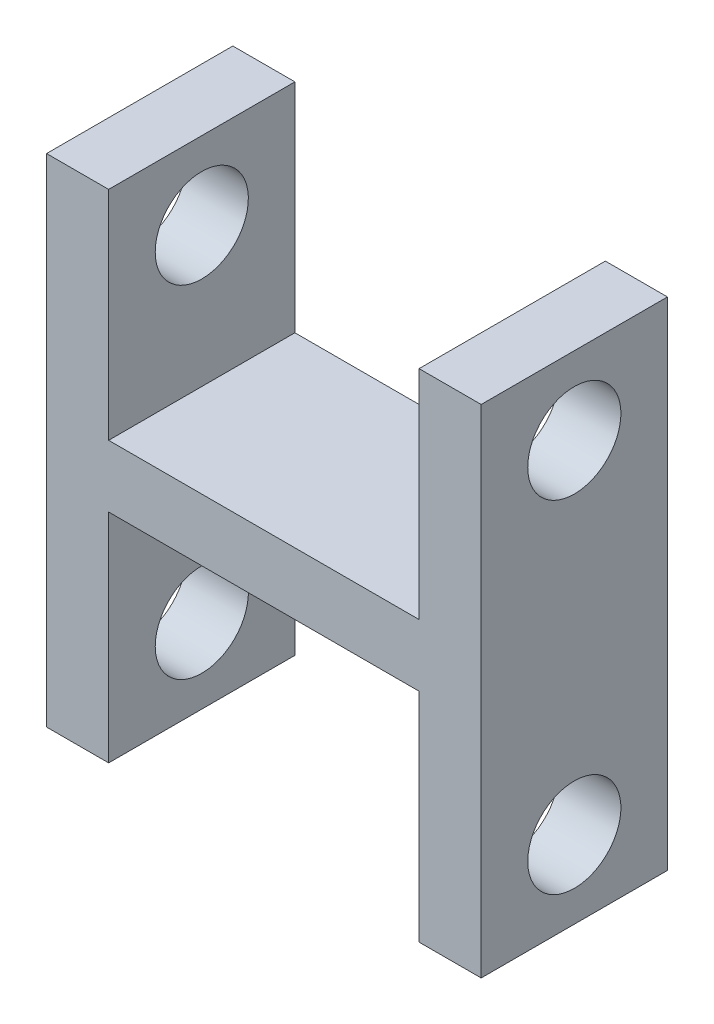
ISO-10303-21;
HEADER;
FILE_DESCRIPTION(('STEP AP214'),'2;1');
FILE_NAME('part.step','',(''),(''),'','','');
FILE_SCHEMA(('AUTOMOTIVE_DESIGN { 1 0 10303 214 1 1 1 1 }'));
ENDSEC;
DATA;
#1=APPLICATION_CONTEXT('core data for automotive mechanical design processes');
#2=APPLICATION_PROTOCOL_DEFINITION('international standard','automotive_design',2000,#1);
#3=PRODUCT_CONTEXT('',#1,'mechanical');
#4=PRODUCT('Part','Part','',(#3));
#5=PRODUCT_RELATED_PRODUCT_CATEGORY('part','',(#4));
#6=PRODUCT_DEFINITION_FORMATION('','',#4);
#7=PRODUCT_DEFINITION_CONTEXT('part definition',#1,'design');
#8=PRODUCT_DEFINITION('design','',#6,#7);
#9=PRODUCT_DEFINITION_SHAPE('','',#8);
#10=(LENGTH_UNIT() NAMED_UNIT(*) SI_UNIT(.MILLI.,.METRE.));
#11=(NAMED_UNIT(*) PLANE_ANGLE_UNIT() SI_UNIT($,.RADIAN.));
#12=(NAMED_UNIT(*) SI_UNIT($,.STERADIAN.) SOLID_ANGLE_UNIT());
#13=UNCERTAINTY_MEASURE_WITH_UNIT(LENGTH_MEASURE(1.E-05),#10,'distance_accuracy_value','');
#14=(GEOMETRIC_REPRESENTATION_CONTEXT(3) GLOBAL_UNCERTAINTY_ASSIGNED_CONTEXT((#13)) GLOBAL_UNIT_ASSIGNED_CONTEXT((#10,
#11,#12)) REPRESENTATION_CONTEXT('',''));
#15=CARTESIAN_POINT('',(0.,0.,0.));
#16=DIRECTION('',(0.,0.,1.));
#17=DIRECTION('',(1.,0.,0.));
#18=AXIS2_PLACEMENT_3D('',#15,#16,#17);
#19=CARTESIAN_POINT('',(0.,0.,76.2));
#20=DIRECTION('',(0.,1.,0.));
#21=DIRECTION('',(0.,0.,1.));
#22=AXIS2_PLACEMENT_3D('',#19,#20,#21);
#23=PLANE('',#22);
#24=DIRECTION('',(1.,0.,0.));
#25=VECTOR('',#24,1.);
#26=CARTESIAN_POINT('',(0.,0.,0.));
#27=LINE('',#26,#25);
#28=CARTESIAN_POINT('',(0.,0.,0.));
#29=VERTEX_POINT('',#28);
#30=CARTESIAN_POINT('',(25.4,0.,0.));
#31=VERTEX_POINT('',#30);
#32=EDGE_CURVE('E137',#29,#31,#27,.T.);
#33=ORIENTED_EDGE('',*,*,#32,.T.);
#34=DIRECTION('',(0.,0.,1.));
#35=VECTOR('',#34,1.);
#36=CARTESIAN_POINT('',(25.4,0.,0.));
#37=LINE('',#36,#35);
#38=CARTESIAN_POINT('',(25.4,0.,76.2));
#39=VERTEX_POINT('',#38);
#40=EDGE_CURVE('E123',#31,#39,#37,.T.);
#41=ORIENTED_EDGE('',*,*,#40,.T.);
#42=DIRECTION('',(1.,0.,0.));
#43=VECTOR('',#42,1.);
#44=CARTESIAN_POINT('',(0.,0.,76.2));
#45=LINE('',#44,#43);
#46=CARTESIAN_POINT('',(0.,0.,76.2));
#47=VERTEX_POINT('',#46);
#48=EDGE_CURVE('E226',#47,#39,#45,.T.);
#49=ORIENTED_EDGE('',*,*,#48,.F.);
#50=DIRECTION('',(0.,0.,-1.));
#51=VECTOR('',#50,1.);
#52=CARTESIAN_POINT('',(0.,0.,76.2));
#53=LINE('',#52,#51);
#54=EDGE_CURVE('E11',#47,#29,#53,.T.);
#55=ORIENTED_EDGE('',*,*,#54,.T.);
#56=EDGE_LOOP('',(#33,#41,#49,#55));
#57=FACE_BOUND('',#56,.T.);
#58=ADVANCED_FACE('F32',(#57),#23,.F.);
#59=CARTESIAN_POINT('',(0.,203.2,76.2));
#60=DIRECTION('',(0.,-1.,0.));
#61=DIRECTION('',(0.,0.,-1.));
#62=AXIS2_PLACEMENT_3D('',#59,#60,#61);
#63=PLANE('',#62);
#64=DIRECTION('',(-1.,0.,0.));
#65=VECTOR('',#64,1.);
#66=CARTESIAN_POINT('',(0.,203.2,76.2));
#67=LINE('',#66,#65);
#68=CARTESIAN_POINT('',(25.4,203.2,76.2));
#69=VERTEX_POINT('',#68);
#70=CARTESIAN_POINT('',(0.,203.2,76.2));
#71=VERTEX_POINT('',#70);
#72=EDGE_CURVE('E229',#69,#71,#67,.T.);
#73=ORIENTED_EDGE('',*,*,#72,.F.);
#74=DIRECTION('',(0.,0.,1.));
#75=VECTOR('',#74,1.);
#76=CARTESIAN_POINT('',(25.4,203.2,0.));
#77=LINE('',#76,#75);
#78=CARTESIAN_POINT('',(25.4,203.2,0.));
#79=VERTEX_POINT('',#78);
#80=EDGE_CURVE('E215',#79,#69,#77,.T.);
#81=ORIENTED_EDGE('',*,*,#80,.F.);
#82=DIRECTION('',(-1.,0.,0.));
#83=VECTOR('',#82,1.);
#84=CARTESIAN_POINT('',(0.,203.2,0.));
#85=LINE('',#84,#83);
#86=CARTESIAN_POINT('',(0.,203.2,0.));
#87=VERTEX_POINT('',#86);
#88=EDGE_CURVE('E147',#79,#87,#85,.T.);
#89=ORIENTED_EDGE('',*,*,#88,.T.);
#90=DIRECTION('',(0.,0.,-1.));
#91=VECTOR('',#90,1.);
#92=CARTESIAN_POINT('',(0.,203.2,76.2));
#93=LINE('',#92,#91);
#94=EDGE_CURVE('E157',#71,#87,#93,.T.);
#95=ORIENTED_EDGE('',*,*,#94,.F.);
#96=EDGE_LOOP('',(#73,#81,#89,#95));
#97=FACE_BOUND('',#96,.T.);
#98=ADVANCED_FACE('F242',(#97),#63,.F.);
#99=CARTESIAN_POINT('',(0.,0.,76.2));
#100=DIRECTION('',(1.,0.,0.));
#101=DIRECTION('',(0.,0.,-1.));
#102=AXIS2_PLACEMENT_3D('',#99,#100,#101);
#103=PLANE('',#102);
#104=CARTESIAN_POINT('',(0.,31.75,38.1));
#105=DIRECTION('',(-1.,0.,0.));
#106=DIRECTION('',(0.,0.,1.));
#107=AXIS2_PLACEMENT_3D('',#104,#105,#106);
#108=CIRCLE('',#107,19.05);
#109=CARTESIAN_POINT('',(0.,31.75,57.15));
#110=VERTEX_POINT('',#109);
#111=EDGE_CURVE('E300',#110,#110,#108,.T.);
#112=ORIENTED_EDGE('',*,*,#111,.F.);
#113=EDGE_LOOP('',(#112));
#114=FACE_BOUND('',#113,.T.);
#115=CARTESIAN_POINT('',(0.,171.45,38.1));
#116=DIRECTION('',(-1.,0.,0.));
#117=DIRECTION('',(0.,0.,1.));
#118=AXIS2_PLACEMENT_3D('',#115,#116,#117);
#119=CIRCLE('',#118,19.05);
#120=CARTESIAN_POINT('',(0.,171.45,57.15));
#121=VERTEX_POINT('',#120);
#122=EDGE_CURVE('E168',#121,#121,#119,.T.);
#123=ORIENTED_EDGE('',*,*,#122,.F.);
#124=EDGE_LOOP('',(#123));
#125=FACE_BOUND('',#124,.T.);
#126=DIRECTION('',(0.,-1.,0.));
#127=VECTOR('',#126,1.);
#128=CARTESIAN_POINT('',(0.,0.,0.));
#129=LINE('',#128,#127);
#130=EDGE_CURVE('E149',#87,#29,#129,.T.);
#131=ORIENTED_EDGE('',*,*,#130,.T.);
#132=ORIENTED_EDGE('',*,*,#54,.F.);
#133=DIRECTION('',(0.,-1.,0.));
#134=VECTOR('',#133,1.);
#135=CARTESIAN_POINT('',(0.,0.,76.2));
#136=LINE('',#135,#134);
#137=EDGE_CURVE('E156',#71,#47,#136,.T.);
#138=ORIENTED_EDGE('',*,*,#137,.F.);
#139=ORIENTED_EDGE('',*,*,#94,.T.);
#140=EDGE_LOOP('',(#131,#132,#138,#139));
#141=FACE_BOUND('',#140,.T.);
#142=ADVANCED_FACE('F34',(#114,#125,#141),#103,.F.);
#143=CARTESIAN_POINT('',(152.4,0.,76.2));
#144=VERTEX_POINT('',#143);
#145=CARTESIAN_POINT('',(177.8,0.,76.2));
#146=VERTEX_POINT('',#145);
#147=EDGE_CURVE('E225',#144,#146,#45,.T.);
#148=ORIENTED_EDGE('',*,*,#147,.F.);
#149=DIRECTION('',(0.,0.,1.));
#150=VECTOR('',#149,1.);
#151=CARTESIAN_POINT('',(152.4,0.,0.));
#152=LINE('',#151,#150);
#153=CARTESIAN_POINT('',(152.4,0.,0.));
#154=VERTEX_POINT('',#153);
#155=EDGE_CURVE('E132',#154,#144,#152,.T.);
#156=ORIENTED_EDGE('',*,*,#155,.F.);
#157=CARTESIAN_POINT('',(177.8,0.,0.));
#158=VERTEX_POINT('',#157);
#159=EDGE_CURVE('E145',#154,#158,#27,.T.);
#160=ORIENTED_EDGE('',*,*,#159,.T.);
#161=DIRECTION('',(0.,0.,-1.));
#162=VECTOR('',#161,1.);
#163=CARTESIAN_POINT('',(177.8,0.,76.2));
#164=LINE('',#163,#162);
#165=EDGE_CURVE('E41',#146,#158,#164,.T.);
#166=ORIENTED_EDGE('',*,*,#165,.F.);
#167=EDGE_LOOP('',(#148,#156,#160,#166));
#168=FACE_BOUND('',#167,.T.);
#169=ADVANCED_FACE('F263',(#168),#23,.F.);
#170=CARTESIAN_POINT('',(177.8,0.,76.2));
#171=DIRECTION('',(-1.,0.,0.));
#172=DIRECTION('',(0.,0.,1.));
#173=AXIS2_PLACEMENT_3D('',#170,#171,#172);
#174=PLANE('',#173);
#175=CARTESIAN_POINT('',(177.8,31.75,38.1));
#176=DIRECTION('',(-1.,0.,0.));
#177=DIRECTION('',(0.,0.,1.));
#178=AXIS2_PLACEMENT_3D('',#175,#176,#177);
#179=CIRCLE('',#178,19.05);
#180=CARTESIAN_POINT('',(177.8,31.75,57.15));
#181=VERTEX_POINT('',#180);
#182=EDGE_CURVE('E175',#181,#181,#179,.T.);
#183=ORIENTED_EDGE('',*,*,#182,.T.);
#184=EDGE_LOOP('',(#183));
#185=FACE_BOUND('',#184,.T.);
#186=CARTESIAN_POINT('',(177.8,171.45,38.1));
#187=DIRECTION('',(-1.,0.,0.));
#188=DIRECTION('',(0.,0.,1.));
#189=AXIS2_PLACEMENT_3D('',#186,#187,#188);
#190=CIRCLE('',#189,19.05);
#191=CARTESIAN_POINT('',(177.8,171.45,57.15));
#192=VERTEX_POINT('',#191);
#193=EDGE_CURVE('E172',#192,#192,#190,.T.);
#194=ORIENTED_EDGE('',*,*,#193,.T.);
#195=EDGE_LOOP('',(#194));
#196=FACE_BOUND('',#195,.T.);
#197=DIRECTION('',(0.,1.,0.));
#198=VECTOR('',#197,1.);
#199=CARTESIAN_POINT('',(177.8,0.,0.));
#200=LINE('',#199,#198);
#201=CARTESIAN_POINT('',(177.8,203.2,0.));
#202=VERTEX_POINT('',#201);
#203=EDGE_CURVE('E144',#158,#202,#200,.T.);
#204=ORIENTED_EDGE('',*,*,#203,.T.);
#205=DIRECTION('',(0.,0.,-1.));
#206=VECTOR('',#205,1.);
#207=CARTESIAN_POINT('',(177.8,203.2,76.2));
#208=LINE('',#207,#206);
#209=CARTESIAN_POINT('',(177.8,203.2,76.2));
#210=VERTEX_POINT('',#209);
#211=EDGE_CURVE('E160',#210,#202,#208,.T.);
#212=ORIENTED_EDGE('',*,*,#211,.F.);
#213=DIRECTION('',(0.,1.,0.));
#214=VECTOR('',#213,1.);
#215=CARTESIAN_POINT('',(177.8,0.,76.2));
#216=LINE('',#215,#214);
#217=EDGE_CURVE('E228',#146,#210,#216,.T.);
#218=ORIENTED_EDGE('',*,*,#217,.F.);
#219=ORIENTED_EDGE('',*,*,#165,.T.);
#220=EDGE_LOOP('',(#204,#212,#218,#219));
#221=FACE_BOUND('',#220,.T.);
#222=ADVANCED_FACE('F258',(#185,#196,#221),#174,.F.);
#223=CARTESIAN_POINT('',(152.4,203.2,0.));
#224=VERTEX_POINT('',#223);
#225=EDGE_CURVE('E153',#202,#224,#85,.T.);
#226=ORIENTED_EDGE('',*,*,#225,.T.);
#227=DIRECTION('',(0.,0.,1.));
#228=VECTOR('',#227,1.);
#229=CARTESIAN_POINT('',(152.4,203.2,0.));
#230=LINE('',#229,#228);
#231=CARTESIAN_POINT('',(152.4,203.2,76.2));
#232=VERTEX_POINT('',#231);
#233=EDGE_CURVE('E217',#224,#232,#230,.T.);
#234=ORIENTED_EDGE('',*,*,#233,.T.);
#235=EDGE_CURVE('E161',#210,#232,#67,.T.);
#236=ORIENTED_EDGE('',*,*,#235,.F.);
#237=ORIENTED_EDGE('',*,*,#211,.T.);
#238=EDGE_LOOP('',(#226,#234,#236,#237));
#239=FACE_BOUND('',#238,.T.);
#240=ADVANCED_FACE('F252',(#239),#63,.F.);
#241=CARTESIAN_POINT('',(0.,0.,76.2));
#242=DIRECTION('',(0.,0.,-1.));
#243=DIRECTION('',(-1.,0.,0.));
#244=AXIS2_PLACEMENT_3D('',#241,#242,#243);
#245=PLANE('',#244);
#246=ORIENTED_EDGE('',*,*,#48,.T.);
#247=DIRECTION('',(0.,-1.,0.));
#248=VECTOR('',#247,1.);
#249=CARTESIAN_POINT('',(25.4,0.,76.2));
#250=LINE('',#249,#248);
#251=CARTESIAN_POINT('',(25.4,88.9,76.2));
#252=VERTEX_POINT('',#251);
#253=EDGE_CURVE('E128',#252,#39,#250,.T.);
#254=ORIENTED_EDGE('',*,*,#253,.F.);
#255=DIRECTION('',(-1.,0.,0.));
#256=VECTOR('',#255,1.);
#257=CARTESIAN_POINT('',(25.4,88.9,76.2));
#258=LINE('',#257,#256);
#259=CARTESIAN_POINT('',(152.4,88.9,76.2));
#260=VERTEX_POINT('',#259);
#261=EDGE_CURVE('E140',#260,#252,#258,.T.);
#262=ORIENTED_EDGE('',*,*,#261,.F.);
#263=DIRECTION('',(0.,1.,0.));
#264=VECTOR('',#263,1.);
#265=CARTESIAN_POINT('',(152.4,0.,76.2));
#266=LINE('',#265,#264);
#267=EDGE_CURVE('E189',#144,#260,#266,.T.);
#268=ORIENTED_EDGE('',*,*,#267,.F.);
#269=ORIENTED_EDGE('',*,*,#147,.T.);
#270=ORIENTED_EDGE('',*,*,#217,.T.);
#271=ORIENTED_EDGE('',*,*,#235,.T.);
#272=DIRECTION('',(0.,1.,0.));
#273=VECTOR('',#272,1.);
#274=CARTESIAN_POINT('',(152.4,203.2,76.2));
#275=LINE('',#274,#273);
#276=CARTESIAN_POINT('',(152.4,114.3,76.2));
#277=VERTEX_POINT('',#276);
#278=EDGE_CURVE('E204',#277,#232,#275,.T.);
#279=ORIENTED_EDGE('',*,*,#278,.F.);
#280=DIRECTION('',(1.,0.,0.));
#281=VECTOR('',#280,1.);
#282=CARTESIAN_POINT('',(25.4,114.3,76.2));
#283=LINE('',#282,#281);
#284=CARTESIAN_POINT('',(25.4,114.3,76.2));
#285=VERTEX_POINT('',#284);
#286=EDGE_CURVE('E211',#285,#277,#283,.T.);
#287=ORIENTED_EDGE('',*,*,#286,.F.);
#288=DIRECTION('',(0.,-1.,0.));
#289=VECTOR('',#288,1.);
#290=CARTESIAN_POINT('',(25.4,203.2,76.2));
#291=LINE('',#290,#289);
#292=EDGE_CURVE('E196',#69,#285,#291,.T.);
#293=ORIENTED_EDGE('',*,*,#292,.F.);
#294=ORIENTED_EDGE('',*,*,#72,.T.);
#295=ORIENTED_EDGE('',*,*,#137,.T.);
#296=EDGE_LOOP('',(#246,#254,#262,#268,#269,#270,#271,#279,#287,#293,#294,#295));
#297=FACE_BOUND('',#296,.T.);
#298=ADVANCED_FACE('F237',(#297),#245,.F.);
#299=CARTESIAN_POINT('',(0.,0.,0.));
#300=DIRECTION('',(0.,0.,-1.));
#301=DIRECTION('',(-1.,0.,0.));
#302=AXIS2_PLACEMENT_3D('',#299,#300,#301);
#303=PLANE('',#302);
#304=DIRECTION('',(0.,-1.,0.));
#305=VECTOR('',#304,1.);
#306=CARTESIAN_POINT('',(25.4,0.,0.));
#307=LINE('',#306,#305);
#308=CARTESIAN_POINT('',(25.4,88.9,0.));
#309=VERTEX_POINT('',#308);
#310=EDGE_CURVE('E126',#309,#31,#307,.T.);
#311=ORIENTED_EDGE('',*,*,#310,.T.);
#312=ORIENTED_EDGE('',*,*,#32,.F.);
#313=ORIENTED_EDGE('',*,*,#130,.F.);
#314=ORIENTED_EDGE('',*,*,#88,.F.);
#315=DIRECTION('',(0.,-1.,0.));
#316=VECTOR('',#315,1.);
#317=CARTESIAN_POINT('',(25.4,203.2,0.));
#318=LINE('',#317,#316);
#319=CARTESIAN_POINT('',(25.4,114.3,0.));
#320=VERTEX_POINT('',#319);
#321=EDGE_CURVE('E200',#79,#320,#318,.T.);
#322=ORIENTED_EDGE('',*,*,#321,.T.);
#323=DIRECTION('',(1.,0.,0.));
#324=VECTOR('',#323,1.);
#325=CARTESIAN_POINT('',(25.4,114.3,0.));
#326=LINE('',#325,#324);
#327=CARTESIAN_POINT('',(152.4,114.3,0.));
#328=VERTEX_POINT('',#327);
#329=EDGE_CURVE('E203',#320,#328,#326,.T.);
#330=ORIENTED_EDGE('',*,*,#329,.T.);
#331=DIRECTION('',(0.,1.,0.));
#332=VECTOR('',#331,1.);
#333=CARTESIAN_POINT('',(152.4,203.2,0.));
#334=LINE('',#333,#332);
#335=EDGE_CURVE('E57',#328,#224,#334,.T.);
#336=ORIENTED_EDGE('',*,*,#335,.T.);
#337=ORIENTED_EDGE('',*,*,#225,.F.);
#338=ORIENTED_EDGE('',*,*,#203,.F.);
#339=ORIENTED_EDGE('',*,*,#159,.F.);
#340=DIRECTION('',(0.,1.,0.));
#341=VECTOR('',#340,1.);
#342=CARTESIAN_POINT('',(152.4,0.,0.));
#343=LINE('',#342,#341);
#344=CARTESIAN_POINT('',(152.4,88.9,0.));
#345=VERTEX_POINT('',#344);
#346=EDGE_CURVE('E139',#154,#345,#343,.T.);
#347=ORIENTED_EDGE('',*,*,#346,.T.);
#348=DIRECTION('',(-1.,0.,0.));
#349=VECTOR('',#348,1.);
#350=CARTESIAN_POINT('',(25.4,88.9,0.));
#351=LINE('',#350,#349);
#352=EDGE_CURVE('E49',#345,#309,#351,.T.);
#353=ORIENTED_EDGE('',*,*,#352,.T.);
#354=EDGE_LOOP('',(#311,#312,#313,#314,#322,#330,#336,#337,#338,#339,#347,#353));
#355=FACE_BOUND('',#354,.T.);
#356=ADVANCED_FACE('F135',(#355),#303,.T.);
#357=CARTESIAN_POINT('',(25.4,203.2,0.));
#358=DIRECTION('',(-1.,0.,0.));
#359=DIRECTION('',(0.,-1.,0.));
#360=AXIS2_PLACEMENT_3D('',#357,#358,#359);
#361=PLANE('',#360);
#362=CARTESIAN_POINT('',(25.4,171.45,38.1));
#363=DIRECTION('',(-1.,0.,0.));
#364=DIRECTION('',(0.,-1.,0.));
#365=AXIS2_PLACEMENT_3D('',#362,#363,#364);
#366=CIRCLE('',#365,19.05);
#367=CARTESIAN_POINT('',(25.4,152.4,38.1));
#368=VERTEX_POINT('',#367);
#369=EDGE_CURVE('E167',#368,#368,#366,.T.);
#370=ORIENTED_EDGE('',*,*,#369,.T.);
#371=EDGE_LOOP('',(#370));
#372=FACE_BOUND('',#371,.T.);
#373=ORIENTED_EDGE('',*,*,#292,.T.);
#374=DIRECTION('',(0.,0.,1.));
#375=VECTOR('',#374,1.);
#376=CARTESIAN_POINT('',(25.4,114.3,0.));
#377=LINE('',#376,#375);
#378=EDGE_CURVE('E208',#320,#285,#377,.T.);
#379=ORIENTED_EDGE('',*,*,#378,.F.);
#380=ORIENTED_EDGE('',*,*,#321,.F.);
#381=ORIENTED_EDGE('',*,*,#80,.T.);
#382=EDGE_LOOP('',(#373,#379,#380,#381));
#383=FACE_BOUND('',#382,.T.);
#384=ADVANCED_FACE('F247',(#372,#383),#361,.F.);
#385=CARTESIAN_POINT('',(152.4,203.2,0.));
#386=DIRECTION('',(1.,0.,0.));
#387=DIRECTION('',(0.,0.,-1.));
#388=AXIS2_PLACEMENT_3D('',#385,#386,#387);
#389=PLANE('',#388);
#390=CARTESIAN_POINT('',(152.4,171.45,38.1));
#391=DIRECTION('',(1.,0.,0.));
#392=DIRECTION('',(0.,0.,-1.));
#393=AXIS2_PLACEMENT_3D('',#390,#391,#392);
#394=CIRCLE('',#393,19.05);
#395=CARTESIAN_POINT('',(152.4,171.45,19.05));
#396=VERTEX_POINT('',#395);
#397=EDGE_CURVE('E165',#396,#396,#394,.T.);
#398=ORIENTED_EDGE('',*,*,#397,.T.);
#399=EDGE_LOOP('',(#398));
#400=FACE_BOUND('',#399,.T.);
#401=ORIENTED_EDGE('',*,*,#278,.T.);
#402=ORIENTED_EDGE('',*,*,#233,.F.);
#403=ORIENTED_EDGE('',*,*,#335,.F.);
#404=DIRECTION('',(0.,0.,1.));
#405=VECTOR('',#404,1.);
#406=CARTESIAN_POINT('',(152.4,114.3,0.));
#407=LINE('',#406,#405);
#408=EDGE_CURVE('E220',#328,#277,#407,.T.);
#409=ORIENTED_EDGE('',*,*,#408,.T.);
#410=EDGE_LOOP('',(#401,#402,#403,#409));
#411=FACE_BOUND('',#410,.T.);
#412=ADVANCED_FACE('F250',(#400,#411),#389,.F.);
#413=CARTESIAN_POINT('',(25.4,114.3,0.));
#414=DIRECTION('',(0.,-1.,0.));
#415=DIRECTION('',(0.,0.,-1.));
#416=AXIS2_PLACEMENT_3D('',#413,#414,#415);
#417=PLANE('',#416);
#418=ORIENTED_EDGE('',*,*,#286,.T.);
#419=ORIENTED_EDGE('',*,*,#408,.F.);
#420=ORIENTED_EDGE('',*,*,#329,.F.);
#421=ORIENTED_EDGE('',*,*,#378,.T.);
#422=EDGE_LOOP('',(#418,#419,#420,#421));
#423=FACE_BOUND('',#422,.T.);
#424=ADVANCED_FACE('F249',(#423),#417,.F.);
#425=CARTESIAN_POINT('',(25.4,0.,0.));
#426=DIRECTION('',(-1.,0.,0.));
#427=DIRECTION('',(0.,0.,1.));
#428=AXIS2_PLACEMENT_3D('',#425,#426,#427);
#429=PLANE('',#428);
#430=CARTESIAN_POINT('',(25.4,31.75,38.1));
#431=DIRECTION('',(-1.,0.,0.));
#432=DIRECTION('',(0.,0.,1.));
#433=AXIS2_PLACEMENT_3D('',#430,#431,#432);
#434=CIRCLE('',#433,19.05);
#435=CARTESIAN_POINT('',(25.4,31.75,57.15));
#436=VERTEX_POINT('',#435);
#437=EDGE_CURVE('E180',#436,#436,#434,.T.);
#438=ORIENTED_EDGE('',*,*,#437,.T.);
#439=EDGE_LOOP('',(#438));
#440=FACE_BOUND('',#439,.T.);
#441=ORIENTED_EDGE('',*,*,#253,.T.);
#442=ORIENTED_EDGE('',*,*,#40,.F.);
#443=ORIENTED_EDGE('',*,*,#310,.F.);
#444=DIRECTION('',(0.,0.,1.));
#445=VECTOR('',#444,1.);
#446=CARTESIAN_POINT('',(25.4,88.9,0.));
#447=LINE('',#446,#445);
#448=EDGE_CURVE('E194',#309,#252,#447,.T.);
#449=ORIENTED_EDGE('',*,*,#448,.T.);
#450=EDGE_LOOP('',(#441,#442,#443,#449));
#451=FACE_BOUND('',#450,.T.);
#452=ADVANCED_FACE('F125',(#440,#451),#429,.F.);
#453=CARTESIAN_POINT('',(25.4,88.9,0.));
#454=DIRECTION('',(0.,1.,0.));
#455=DIRECTION('',(0.,0.,1.));
#456=AXIS2_PLACEMENT_3D('',#453,#454,#455);
#457=PLANE('',#456);
#458=ORIENTED_EDGE('',*,*,#261,.T.);
#459=ORIENTED_EDGE('',*,*,#448,.F.);
#460=ORIENTED_EDGE('',*,*,#352,.F.);
#461=DIRECTION('',(0.,0.,1.));
#462=VECTOR('',#461,1.);
#463=CARTESIAN_POINT('',(152.4,88.9,0.));
#464=LINE('',#463,#462);
#465=EDGE_CURVE('E197',#345,#260,#464,.T.);
#466=ORIENTED_EDGE('',*,*,#465,.T.);
#467=EDGE_LOOP('',(#458,#459,#460,#466));
#468=FACE_BOUND('',#467,.T.);
#469=ADVANCED_FACE('F269',(#468),#457,.F.);
#470=CARTESIAN_POINT('',(152.4,0.,0.));
#471=DIRECTION('',(1.,0.,0.));
#472=DIRECTION('',(0.,0.,-1.));
#473=AXIS2_PLACEMENT_3D('',#470,#471,#472);
#474=PLANE('',#473);
#475=CARTESIAN_POINT('',(152.4,31.75,38.1));
#476=DIRECTION('',(1.,0.,0.));
#477=DIRECTION('',(0.,0.,-1.));
#478=AXIS2_PLACEMENT_3D('',#475,#476,#477);
#479=CIRCLE('',#478,19.05);
#480=CARTESIAN_POINT('',(152.4,31.75,19.05));
#481=VERTEX_POINT('',#480);
#482=EDGE_CURVE('E36',#481,#481,#479,.T.);
#483=ORIENTED_EDGE('',*,*,#482,.T.);
#484=EDGE_LOOP('',(#483));
#485=FACE_BOUND('',#484,.T.);
#486=ORIENTED_EDGE('',*,*,#267,.T.);
#487=ORIENTED_EDGE('',*,*,#465,.F.);
#488=ORIENTED_EDGE('',*,*,#346,.F.);
#489=ORIENTED_EDGE('',*,*,#155,.T.);
#490=EDGE_LOOP('',(#486,#487,#488,#489));
#491=FACE_BOUND('',#490,.T.);
#492=ADVANCED_FACE('F267',(#485,#491),#474,.F.);
#493=CARTESIAN_POINT('',(199.898,171.45,38.1));
#494=DIRECTION('',(-1.,0.,0.));
#495=DIRECTION('',(0.,0.,1.));
#496=AXIS2_PLACEMENT_3D('',#493,#494,#495);
#497=CYLINDRICAL_SURFACE('',#496,19.05);
#498=ORIENTED_EDGE('',*,*,#397,.F.);
#499=EDGE_LOOP('',(#498));
#500=FACE_BOUND('',#499,.T.);
#501=ORIENTED_EDGE('',*,*,#193,.F.);
#502=EDGE_LOOP('',(#501));
#503=FACE_BOUND('',#502,.T.);
#504=ADVANCED_FACE('F276',(#500,#503),#497,.F.);
#505=ORIENTED_EDGE('',*,*,#122,.T.);
#506=EDGE_LOOP('',(#505));
#507=FACE_BOUND('',#506,.T.);
#508=ORIENTED_EDGE('',*,*,#369,.F.);
#509=EDGE_LOOP('',(#508));
#510=FACE_BOUND('',#509,.T.);
#511=ADVANCED_FACE('F314',(#507,#510),#497,.F.);
#512=CARTESIAN_POINT('',(199.898,31.75,38.1));
#513=DIRECTION('',(-1.,0.,0.));
#514=DIRECTION('',(0.,0.,1.));
#515=AXIS2_PLACEMENT_3D('',#512,#513,#514);
#516=CYLINDRICAL_SURFACE('',#515,19.05);
#517=ORIENTED_EDGE('',*,*,#482,.F.);
#518=EDGE_LOOP('',(#517));
#519=FACE_BOUND('',#518,.T.);
#520=ORIENTED_EDGE('',*,*,#182,.F.);
#521=EDGE_LOOP('',(#520));
#522=FACE_BOUND('',#521,.T.);
#523=ADVANCED_FACE('F309',(#519,#522),#516,.F.);
#524=ORIENTED_EDGE('',*,*,#111,.T.);
#525=EDGE_LOOP('',(#524));
#526=FACE_BOUND('',#525,.T.);
#527=ORIENTED_EDGE('',*,*,#437,.F.);
#528=EDGE_LOOP('',(#527));
#529=FACE_BOUND('',#528,.T.);
#530=ADVANCED_FACE('F307',(#526,#529),#516,.F.);
#531=CLOSED_SHELL('',(#58,#98,#142,#169,#222,#240,#298,#356,#384,#412,#424,#452,#469,#492,#504,
#511,#523,#530));
#532=MANIFOLD_SOLID_BREP('B2',#531);
#533=ADVANCED_BREP_SHAPE_REPRESENTATION('',(#18,#532),#14);
#534=SHAPE_DEFINITION_REPRESENTATION(#9,#533);
ENDSEC;
END-ISO-10303-21;
